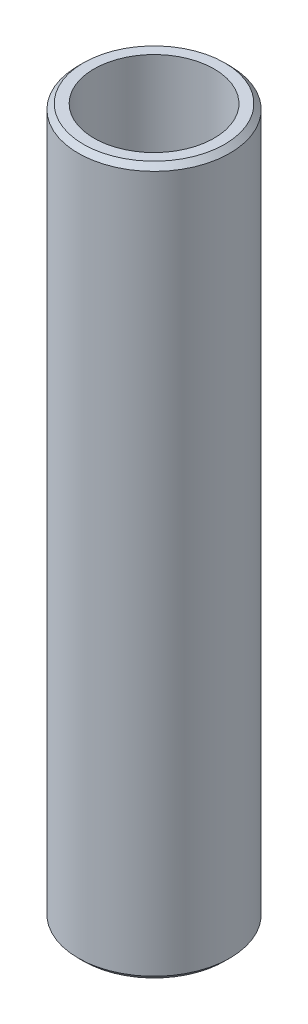
ISO-10303-21;
HEADER;
FILE_DESCRIPTION(('STEP AP214'),'2;1');
FILE_NAME('part.step','',(''),(''),'','','');
FILE_SCHEMA(('AUTOMOTIVE_DESIGN { 1 0 10303 214 1 1 1 1 }'));
ENDSEC;
DATA;
#1=APPLICATION_CONTEXT('core data for automotive mechanical design processes');
#2=APPLICATION_PROTOCOL_DEFINITION('international standard','automotive_design',2000,#1);
#3=PRODUCT_CONTEXT('',#1,'mechanical');
#4=PRODUCT('Part','Part','',(#3));
#5=PRODUCT_RELATED_PRODUCT_CATEGORY('part','',(#4));
#6=PRODUCT_DEFINITION_FORMATION('','',#4);
#7=PRODUCT_DEFINITION_CONTEXT('part definition',#1,'design');
#8=PRODUCT_DEFINITION('design','',#6,#7);
#9=PRODUCT_DEFINITION_SHAPE('','',#8);
#10=(LENGTH_UNIT() NAMED_UNIT(*) SI_UNIT(.MILLI.,.METRE.));
#11=(NAMED_UNIT(*) PLANE_ANGLE_UNIT() SI_UNIT($,.RADIAN.));
#12=(NAMED_UNIT(*) SI_UNIT($,.STERADIAN.) SOLID_ANGLE_UNIT());
#13=UNCERTAINTY_MEASURE_WITH_UNIT(LENGTH_MEASURE(1.E-05),#10,'distance_accuracy_value','');
#14=(GEOMETRIC_REPRESENTATION_CONTEXT(3) GLOBAL_UNCERTAINTY_ASSIGNED_CONTEXT((#13)) GLOBAL_UNIT_ASSIGNED_CONTEXT((#10,
#11,#12)) REPRESENTATION_CONTEXT('',''));
#15=CARTESIAN_POINT('',(0.,0.,0.));
#16=DIRECTION('',(0.,0.,1.));
#17=DIRECTION('',(1.,0.,0.));
#18=AXIS2_PLACEMENT_3D('',#15,#16,#17);
#19=CARTESIAN_POINT('',(0.,490.024110290868,0.));
#20=DIRECTION('',(0.,-1.,0.));
#21=DIRECTION('',(0.,0.,-1.));
#22=AXIS2_PLACEMENT_3D('',#19,#20,#21);
#23=CYLINDRICAL_SURFACE('',#22,52.5);
#24=CARTESIAN_POINT('',(0.,486.444221106267,0.));
#25=DIRECTION('',(0.,1.,0.));
#26=DIRECTION('',(0.,0.,1.));
#27=AXIS2_PLACEMENT_3D('',#24,#25,#26);
#28=CIRCLE('',#27,52.5);
#29=CARTESIAN_POINT('',(0.,486.444221106267,-52.5));
#30=VERTEX_POINT('',#29);
#31=EDGE_CURVE('E50',#30,#30,#28,.F.);
#32=CARTESIAN_POINT('',(0.,3.57988918460167,0.));
#33=DIRECTION('',(0.,1.,0.));
#34=DIRECTION('',(0.,0.,1.));
#35=AXIS2_PLACEMENT_3D('',#32,#33,#34);
#36=CIRCLE('',#35,52.5);
#37=CARTESIAN_POINT('',(0.,3.57988918460167,-52.5));
#38=VERTEX_POINT('',#37);
#39=EDGE_CURVE('E51',#38,#38,#36,.T.);
#40=CARTESIAN_POINT('',(0.,486.444221106267,-52.5));
#41=CARTESIAN_POINT('',(0.,481.414384315416,-52.5));
#42=CARTESIAN_POINT('',(0.,476.384547524565,-52.5));
#43=CARTESIAN_POINT('',(0.,466.324873942864,-52.5));
#44=CARTESIAN_POINT('',(0.,461.295037152013,-52.5));
#45=CARTESIAN_POINT('',(0.,451.235363570312,-52.5));
#46=CARTESIAN_POINT('',(0.,446.205526779461,-52.5));
#47=CARTESIAN_POINT('',(0.,436.14585319776,-52.5));
#48=CARTESIAN_POINT('',(0.,431.116016406909,-52.5));
#49=CARTESIAN_POINT('',(0.,421.056342825208,-52.5));
#50=CARTESIAN_POINT('',(0.,416.026506034357,-52.5));
#51=CARTESIAN_POINT('',(0.,405.966832452656,-52.5));
#52=CARTESIAN_POINT('',(0.,400.936995661805,-52.5));
#53=CARTESIAN_POINT('',(0.,390.877322080104,-52.5));
#54=CARTESIAN_POINT('',(0.,385.847485289253,-52.5));
#55=CARTESIAN_POINT('',(0.,375.787811707552,-52.5));
#56=CARTESIAN_POINT('',(0.,370.757974916701,-52.5));
#57=CARTESIAN_POINT('',(0.,360.698301335,-52.5));
#58=CARTESIAN_POINT('',(0.,355.668464544149,-52.5));
#59=CARTESIAN_POINT('',(0.,345.608790962448,-52.5));
#60=CARTESIAN_POINT('',(0.,340.578954171597,-52.5));
#61=CARTESIAN_POINT('',(0.,330.519280589896,-52.5));
#62=CARTESIAN_POINT('',(0.,325.489443799045,-52.5));
#63=CARTESIAN_POINT('',(0.,315.429770217344,-52.5));
#64=CARTESIAN_POINT('',(0.,310.399933426493,-52.5));
#65=CARTESIAN_POINT('',(0.,300.340259844792,-52.5));
#66=CARTESIAN_POINT('',(0.,295.310423053941,-52.5));
#67=CARTESIAN_POINT('',(0.,285.25074947224,-52.5));
#68=CARTESIAN_POINT('',(0.,280.220912681389,-52.5));
#69=CARTESIAN_POINT('',(0.,270.161239099688,-52.5));
#70=CARTESIAN_POINT('',(0.,265.131402308837,-52.5));
#71=CARTESIAN_POINT('',(0.,255.071728727135,-52.5));
#72=CARTESIAN_POINT('',(0.,250.041891936285,-52.5));
#73=CARTESIAN_POINT('',(0.,239.982218354583,-52.5));
#74=CARTESIAN_POINT('',(0.,234.952381563733,-52.5));
#75=CARTESIAN_POINT('',(0.,224.892707982031,-52.5));
#76=CARTESIAN_POINT('',(0.,219.862871191181,-52.5));
#77=CARTESIAN_POINT('',(0.,209.803197609479,-52.5));
#78=CARTESIAN_POINT('',(0.,204.773360818629,-52.5));
#79=CARTESIAN_POINT('',(0.,194.713687236927,-52.5));
#80=CARTESIAN_POINT('',(0.,189.683850446077,-52.5));
#81=CARTESIAN_POINT('',(0.,179.624176864375,-52.5));
#82=CARTESIAN_POINT('',(0.,174.594340073525,-52.5));
#83=CARTESIAN_POINT('',(0.,164.534666491823,-52.5));
#84=CARTESIAN_POINT('',(0.,159.504829700973,-52.5));
#85=CARTESIAN_POINT('',(0.,149.445156119271,-52.5));
#86=CARTESIAN_POINT('',(0.,144.415319328421,-52.5));
#87=CARTESIAN_POINT('',(0.,134.355645746719,-52.5));
#88=CARTESIAN_POINT('',(0.,129.325808955869,-52.5));
#89=CARTESIAN_POINT('',(0.,119.266135374167,-52.5));
#90=CARTESIAN_POINT('',(0.,114.236298583317,-52.5));
#91=CARTESIAN_POINT('',(0.,104.176625001615,-52.5));
#92=CARTESIAN_POINT('',(0.,99.1467882107645,-52.5));
#93=CARTESIAN_POINT('',(0.,89.0871146290632,-52.5));
#94=CARTESIAN_POINT('',(0.,84.0572778382125,-52.5));
#95=CARTESIAN_POINT('',(0.,73.9976042565111,-52.5));
#96=CARTESIAN_POINT('',(0.,68.9677674656605,-52.5));
#97=CARTESIAN_POINT('',(0.,58.9080938839591,-52.5));
#98=CARTESIAN_POINT('',(0.,53.8782570931085,-52.5));
#99=CARTESIAN_POINT('',(0.,43.8185835114071,-52.5));
#100=CARTESIAN_POINT('',(0.,38.7887467205564,-52.5));
#101=CARTESIAN_POINT('',(0.,28.729073138855,-52.5));
#102=CARTESIAN_POINT('',(0.,23.6992363480044,-52.5));
#103=CARTESIAN_POINT('',(0.,13.639562766303,-52.5));
#104=CARTESIAN_POINT('',(0.,8.60972597545234,-52.5));
#105=CARTESIAN_POINT('',(0.,3.57988918460167,-52.5));
#106=B_SPLINE_CURVE_WITH_KNOTS('',3,(#40,#41,#42,#43,#44,#45,#46,#47,#48,#49,#50,#51,#52,#53,
#54,#55,#56,#57,#58,#59,#60,#61,#62,#63,#64,#65,#66,#67,#68,#69,#70,#71,#72,#73,#74,#75,#76,#77,
#78,#79,#80,#81,#82,#83,#84,#85,#86,#87,#88,#89,#90,#91,#92,#93,#94,#95,#96,#97,#98,#99,#100,
#101,#102,#103,#104,#105),.UNSPECIFIED.,.F.,.F.,(4,2,2,2,2,2,2,2,2,2,2,2,2,2,2,2,2,2,2,2,2,2,2,
2,2,2,2,2,2,2,2,2,4),(0.,15.089510372552,30.179020745104,45.2685311176561,60.3580414902081,
75.4475518627601,90.5370622353122,105.626572607864,120.716082980416,135.805593352968,
150.89510372552,165.984614098072,181.074124470624,196.163634843176,211.253145215728,
226.34265558828,241.432165960832,256.521676333384,271.611186705936,286.700697078488,
301.79020745104,316.879717823593,331.969228196145,347.058738568697,362.148248941249,
377.237759313801,392.327269686353,407.416780058905,422.506290431457,437.595800804009,
452.685311176561,467.774821549113,482.864331921665),.UNSPECIFIED.);
#107=EDGE_CURVE('BSEAM39',#30,#38,#106,.T.);
#108=ORIENTED_EDGE('',*,*,#31,.T.);
#109=ORIENTED_EDGE('',*,*,#39,.T.);
#110=ORIENTED_EDGE('',*,*,#107,.T.);
#111=ORIENTED_EDGE('',*,*,#107,.F.);
#112=EDGE_LOOP('',(#108,#110,#109,#111));
#113=FACE_BOUND('',#112,.T.);
#114=ADVANCED_FACE('F39',(#113),#23,.T.);
#115=CARTESIAN_POINT('',(0.,490.024110290868,0.));
#116=DIRECTION('',(0.,1.,0.));
#117=DIRECTION('',(0.,0.,1.));
#118=AXIS2_PLACEMENT_3D('',#115,#116,#117);
#119=PLANE('',#118);
#120=CARTESIAN_POINT('',(0.,490.024110290868,0.));
#121=DIRECTION('',(0.,1.,0.));
#122=DIRECTION('',(0.,0.,1.));
#123=AXIS2_PLACEMENT_3D('',#120,#121,#122);
#124=CIRCLE('',#123,48.9201108153991);
#125=CARTESIAN_POINT('',(0.,490.024110290868,48.9201108153991));
#126=VERTEX_POINT('',#125);
#127=EDGE_CURVE('E54',#126,#126,#124,.T.);
#128=ORIENTED_EDGE('',*,*,#127,.T.);
#129=EDGE_LOOP('',(#128));
#130=FACE_BOUND('',#129,.T.);
#131=CARTESIAN_POINT('',(0.,490.024110290868,0.));
#132=DIRECTION('',(0.,1.,0.));
#133=DIRECTION('',(0.,0.,1.));
#134=AXIS2_PLACEMENT_3D('',#131,#132,#133);
#135=CIRCLE('',#134,41.6103737604343);
#136=CARTESIAN_POINT('',(0.,490.024110290868,-41.6103737604343));
#137=VERTEX_POINT('',#136);
#138=EDGE_CURVE('E58',#137,#137,#135,.T.);
#139=ORIENTED_EDGE('',*,*,#138,.F.);
#140=EDGE_LOOP('',(#139));
#141=FACE_BOUND('',#140,.T.);
#142=ADVANCED_FACE('F69',(#130,#141),#119,.T.);
#143=CARTESIAN_POINT('',(0.,0.,0.));
#144=DIRECTION('',(0.,1.,0.));
#145=DIRECTION('',(0.,0.,1.));
#146=AXIS2_PLACEMENT_3D('',#143,#144,#145);
#147=PLANE('',#146);
#148=CARTESIAN_POINT('',(0.,0.,0.));
#149=DIRECTION('',(0.,1.,0.));
#150=DIRECTION('',(0.,0.,1.));
#151=AXIS2_PLACEMENT_3D('',#148,#149,#150);
#152=CIRCLE('',#151,48.9201108153983);
#153=CARTESIAN_POINT('',(0.,0.,48.9201108153983));
#154=VERTEX_POINT('',#153);
#155=EDGE_CURVE('E10',#154,#154,#152,.F.);
#156=ORIENTED_EDGE('',*,*,#155,.T.);
#157=EDGE_LOOP('',(#156));
#158=FACE_BOUND('',#157,.T.);
#159=CARTESIAN_POINT('',(0.,0.,0.));
#160=DIRECTION('',(0.,1.,0.));
#161=DIRECTION('',(0.,0.,1.));
#162=AXIS2_PLACEMENT_3D('',#159,#160,#161);
#163=CIRCLE('',#162,41.6103737604343);
#164=CARTESIAN_POINT('',(0.,0.,-41.6103737604343));
#165=VERTEX_POINT('',#164);
#166=EDGE_CURVE('E63',#165,#165,#163,.T.);
#167=ORIENTED_EDGE('',*,*,#166,.T.);
#168=EDGE_LOOP('',(#167));
#169=FACE_BOUND('',#168,.T.);
#170=ADVANCED_FACE('F75',(#158,#169),#147,.F.);
#171=CARTESIAN_POINT('',(0.,490.024110290868,0.));
#172=DIRECTION('',(0.,-1.,0.));
#173=DIRECTION('',(0.,0.,-1.));
#174=AXIS2_PLACEMENT_3D('',#171,#172,#173);
#175=CYLINDRICAL_SURFACE('',#174,41.6103737604343);
#176=CARTESIAN_POINT('',(0.,490.024110290868,-41.6103737604343));
#177=CARTESIAN_POINT('',(0.,484.919692475338,-41.6103737604343));
#178=CARTESIAN_POINT('',(0.,479.815274659808,-41.6103737604343));
#179=CARTESIAN_POINT('',(0.,469.606439028748,-41.6103737604343));
#180=CARTESIAN_POINT('',(0.,464.502021213218,-41.6103737604343));
#181=CARTESIAN_POINT('',(0.,454.293185582158,-41.6103737604343));
#182=CARTESIAN_POINT('',(0.,449.188767766629,-41.6103737604343));
#183=CARTESIAN_POINT('',(0.,438.979932135569,-41.6103737604343));
#184=CARTESIAN_POINT('',(0.,433.875514320039,-41.6103737604343));
#185=CARTESIAN_POINT('',(0.,423.666678688979,-41.6103737604343));
#186=CARTESIAN_POINT('',(0.,418.562260873449,-41.6103737604343));
#187=CARTESIAN_POINT('',(0.,408.35342524239,-41.6103737604343));
#188=CARTESIAN_POINT('',(0.,403.24900742686,-41.6103737604343));
#189=CARTESIAN_POINT('',(0.,393.0401717958,-41.6103737604343));
#190=CARTESIAN_POINT('',(0.,387.93575398027,-41.6103737604343));
#191=CARTESIAN_POINT('',(0.,377.72691834921,-41.6103737604343));
#192=CARTESIAN_POINT('',(0.,372.622500533681,-41.6103737604343));
#193=CARTESIAN_POINT('',(0.,362.413664902621,-41.6103737604343));
#194=CARTESIAN_POINT('',(0.,357.309247087091,-41.6103737604343));
#195=CARTESIAN_POINT('',(0.,347.100411456031,-41.6103737604343));
#196=CARTESIAN_POINT('',(0.,341.995993640501,-41.6103737604343));
#197=CARTESIAN_POINT('',(0.,331.787158009442,-41.6103737604343));
#198=CARTESIAN_POINT('',(0.,326.682740193912,-41.6103737604343));
#199=CARTESIAN_POINT('',(0.,316.473904562852,-41.6103737604343));
#200=CARTESIAN_POINT('',(0.,311.369486747322,-41.6103737604343));
#201=CARTESIAN_POINT('',(0.,301.160651116262,-41.6103737604343));
#202=CARTESIAN_POINT('',(0.,296.056233300732,-41.6103737604343));
#203=CARTESIAN_POINT('',(0.,285.847397669673,-41.6103737604343));
#204=CARTESIAN_POINT('',(0.,280.742979854143,-41.6103737604343));
#205=CARTESIAN_POINT('',(0.,270.534144223083,-41.6103737604343));
#206=CARTESIAN_POINT('',(0.,265.429726407553,-41.6103737604343));
#207=CARTESIAN_POINT('',(0.,255.220890776493,-41.6103737604343));
#208=CARTESIAN_POINT('',(0.,250.116472960964,-41.6103737604343));
#209=CARTESIAN_POINT('',(0.,239.907637329904,-41.6103737604343));
#210=CARTESIAN_POINT('',(0.,234.803219514374,-41.6103737604343));
#211=CARTESIAN_POINT('',(0.,224.594383883314,-41.6103737604343));
#212=CARTESIAN_POINT('',(0.,219.489966067784,-41.6103737604343));
#213=CARTESIAN_POINT('',(0.,209.281130436725,-41.6103737604343));
#214=CARTESIAN_POINT('',(0.,204.176712621195,-41.6103737604343));
#215=CARTESIAN_POINT('',(0.,193.967876990135,-41.6103737604343));
#216=CARTESIAN_POINT('',(0.,188.863459174605,-41.6103737604343));
#217=CARTESIAN_POINT('',(0.,178.654623543545,-41.6103737604343));
#218=CARTESIAN_POINT('',(0.,173.550205728016,-41.6103737604343));
#219=CARTESIAN_POINT('',(0.,163.341370096956,-41.6103737604343));
#220=CARTESIAN_POINT('',(0.,158.236952281426,-41.6103737604343));
#221=CARTESIAN_POINT('',(0.,148.028116650366,-41.6103737604343));
#222=CARTESIAN_POINT('',(0.,142.923698834836,-41.6103737604343));
#223=CARTESIAN_POINT('',(0.,132.714863203777,-41.6103737604343));
#224=CARTESIAN_POINT('',(0.,127.610445388247,-41.6103737604343));
#225=CARTESIAN_POINT('',(0.,117.401609757187,-41.6103737604343));
#226=CARTESIAN_POINT('',(0.,112.297191941657,-41.6103737604343));
#227=CARTESIAN_POINT('',(0.,102.088356310597,-41.6103737604343));
#228=CARTESIAN_POINT('',(0.,96.9839384950675,-41.6103737604343));
#229=CARTESIAN_POINT('',(0.,86.7751028640078,-41.6103737604343));
#230=CARTESIAN_POINT('',(0.,81.6706850484779,-41.6103737604343));
#231=CARTESIAN_POINT('',(0.,71.4618494174181,-41.6103737604343));
#232=CARTESIAN_POINT('',(0.,66.3574316018883,-41.6103737604343));
#233=CARTESIAN_POINT('',(0.,56.1485959708285,-41.6103737604343));
#234=CARTESIAN_POINT('',(0.,51.0441781552986,-41.6103737604343));
#235=CARTESIAN_POINT('',(0.,40.8353425242389,-41.6103737604343));
#236=CARTESIAN_POINT('',(0.,35.7309247087091,-41.6103737604343));
#237=CARTESIAN_POINT('',(0.,25.5220890776493,-41.6103737604343));
#238=CARTESIAN_POINT('',(0.,20.4176712621194,-41.6103737604343));
#239=CARTESIAN_POINT('',(0.,10.2088356310597,-41.6103737604343));
#240=CARTESIAN_POINT('',(0.,5.10441781552983,-41.6103737604343));
#241=CARTESIAN_POINT('',(0.,0.,-41.6103737604343));
#242=B_SPLINE_CURVE_WITH_KNOTS('',3,(#176,#177,#178,#179,#180,#181,#182,#183,#184,#185,#186,
#187,#188,#189,#190,#191,#192,#193,#194,#195,#196,#197,#198,#199,#200,#201,#202,#203,#204,#205,
#206,#207,#208,#209,#210,#211,#212,#213,#214,#215,#216,#217,#218,#219,#220,#221,#222,#223,#224,
#225,#226,#227,#228,#229,#230,#231,#232,#233,#234,#235,#236,#237,#238,#239,#240,#241),
.UNSPECIFIED.,.F.,.F.,(4,2,2,2,2,2,2,2,2,2,2,2,2,2,2,2,2,2,2,2,2,2,2,2,2,2,2,2,2,2,2,2,4),(0.,
15.3132534465896,30.6265068931793,45.9397603397689,61.2530137863585,76.5662672329481,
91.8795206795377,107.192774126127,122.506027572717,137.819281019307,153.132534465896,
168.445787912486,183.759041359075,199.072294805665,214.385548252255,229.698801698844,
245.012055145434,260.325308592023,275.638562038613,290.951815485203,306.265068931792,
321.578322378382,336.891575824971,352.204829271561,367.518082718151,382.83133616474,
398.14458961133,413.45784305792,428.771096504509,444.084349951099,459.397603397688,
474.710856844278,490.024110290868),.UNSPECIFIED.);
#243=EDGE_CURVE('BSEAM70',#137,#165,#242,.T.);
#244=ORIENTED_EDGE('',*,*,#138,.T.);
#245=ORIENTED_EDGE('',*,*,#166,.F.);
#246=ORIENTED_EDGE('',*,*,#243,.T.);
#247=ORIENTED_EDGE('',*,*,#243,.F.);
#248=EDGE_LOOP('',(#244,#246,#245,#247));
#249=FACE_BOUND('',#248,.T.);
#250=ADVANCED_FACE('F70',(#249),#175,.F.);
#251=CARTESIAN_POINT('',(0.,490.024110290868,0.));
#252=DIRECTION('',(0.,-1.,0.));
#253=DIRECTION('',(0.,0.,-1.));
#254=AXIS2_PLACEMENT_3D('',#251,#252,#253);
#255=CONICAL_SURFACE('',#254,48.9201108153991,0.785398163397443);
#256=ORIENTED_EDGE('',*,*,#31,.F.);
#257=EDGE_LOOP('',(#256));
#258=FACE_BOUND('',#257,.T.);
#259=ORIENTED_EDGE('',*,*,#127,.F.);
#260=EDGE_LOOP('',(#259));
#261=FACE_BOUND('',#260,.T.);
#262=ADVANCED_FACE('F81',(#258,#261),#255,.T.);
#263=CARTESIAN_POINT('',(0.,3.57988918460167,0.));
#264=DIRECTION('',(0.,1.,0.));
#265=DIRECTION('',(0.,0.,1.));
#266=AXIS2_PLACEMENT_3D('',#263,#264,#265);
#267=CONICAL_SURFACE('',#266,52.5,0.785398163397451);
#268=ORIENTED_EDGE('',*,*,#155,.F.);
#269=EDGE_LOOP('',(#268));
#270=FACE_BOUND('',#269,.T.);
#271=ORIENTED_EDGE('',*,*,#39,.F.);
#272=EDGE_LOOP('',(#271));
#273=FACE_BOUND('',#272,.T.);
#274=ADVANCED_FACE('F45',(#270,#273),#267,.T.);
#275=CLOSED_SHELL('',(#114,#142,#170,#250,#262,#274));
#276=MANIFOLD_SOLID_BREP('B2',#275);
#277=ADVANCED_BREP_SHAPE_REPRESENTATION('',(#18,#276),#14);
#278=SHAPE_DEFINITION_REPRESENTATION(#9,#277);
ENDSEC;
END-ISO-10303-21;
